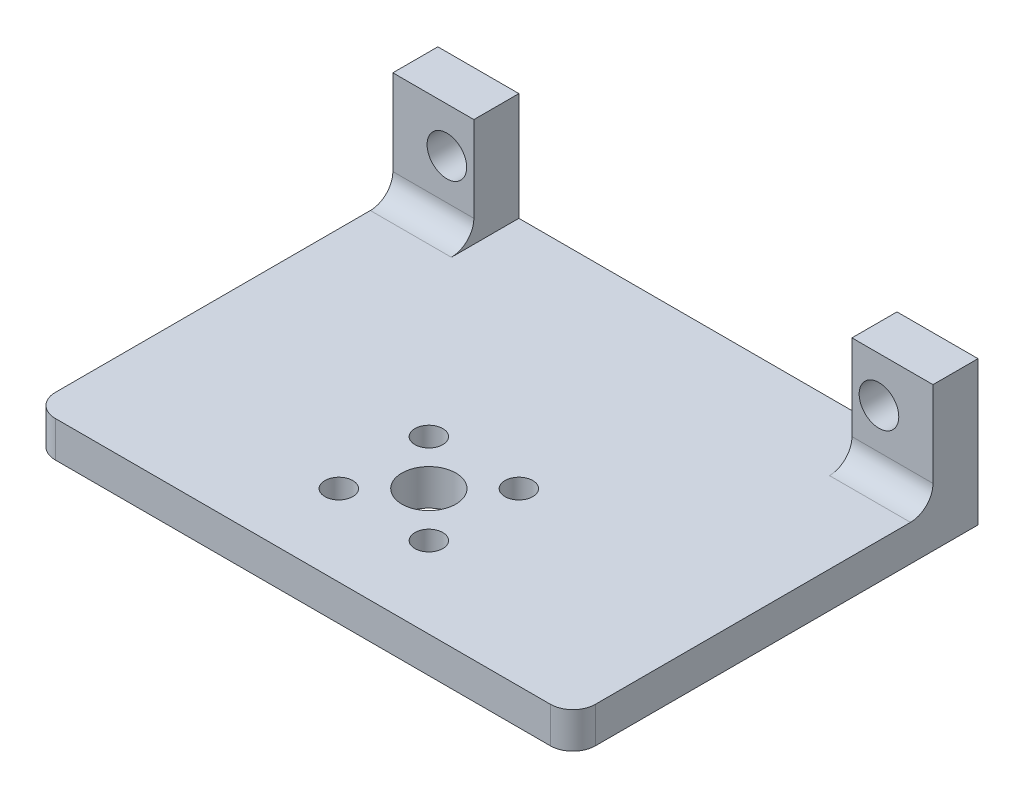
ISO-10303-21;
HEADER;
FILE_DESCRIPTION(('STEP AP214'),'2;1');
FILE_NAME('part.step','',(''),(''),'','','');
FILE_SCHEMA(('AUTOMOTIVE_DESIGN { 1 0 10303 214 1 1 1 1 }'));
ENDSEC;
DATA;
#1=APPLICATION_CONTEXT('core data for automotive mechanical design processes');
#2=APPLICATION_PROTOCOL_DEFINITION('international standard','automotive_design',2000,#1);
#3=PRODUCT_CONTEXT('',#1,'mechanical');
#4=PRODUCT('Part','Part','',(#3));
#5=PRODUCT_RELATED_PRODUCT_CATEGORY('part','',(#4));
#6=PRODUCT_DEFINITION_FORMATION('','',#4);
#7=PRODUCT_DEFINITION_CONTEXT('part definition',#1,'design');
#8=PRODUCT_DEFINITION('design','',#6,#7);
#9=PRODUCT_DEFINITION_SHAPE('','',#8);
#10=(LENGTH_UNIT() NAMED_UNIT(*) SI_UNIT(.MILLI.,.METRE.));
#11=(NAMED_UNIT(*) PLANE_ANGLE_UNIT() SI_UNIT($,.RADIAN.));
#12=(NAMED_UNIT(*) SI_UNIT($,.STERADIAN.) SOLID_ANGLE_UNIT());
#13=UNCERTAINTY_MEASURE_WITH_UNIT(LENGTH_MEASURE(1.E-05),#10,'distance_accuracy_value','');
#14=(GEOMETRIC_REPRESENTATION_CONTEXT(3) GLOBAL_UNCERTAINTY_ASSIGNED_CONTEXT((#13)) GLOBAL_UNIT_ASSIGNED_CONTEXT((#10,
#11,#12)) REPRESENTATION_CONTEXT('',''));
#15=CARTESIAN_POINT('',(0.,0.,0.));
#16=DIRECTION('',(0.,0.,1.));
#17=DIRECTION('',(1.,0.,0.));
#18=AXIS2_PLACEMENT_3D('',#15,#16,#17);
#19=CARTESIAN_POINT('',(0.,7.68517619511929,45.));
#20=DIRECTION('',(0.,1.,0.));
#21=DIRECTION('',(-1.,0.,0.));
#22=AXIS2_PLACEMENT_3D('',#19,#20,#21);
#23=PLANE('',#22);
#24=CARTESIAN_POINT('',(-87.025641025641,7.68517619511928,36.));
#25=DIRECTION('',(0.,1.,0.));
#26=DIRECTION('',(1.,0.,0.));
#27=AXIS2_PLACEMENT_3D('',#24,#25,#26);
#28=CIRCLE('',#27,1.54999999999999);
#29=CARTESIAN_POINT('',(-85.475641025641,7.68517619511928,36.));
#30=VERTEX_POINT('',#29);
#31=EDGE_CURVE('E389',#30,#30,#28,.T.);
#32=ORIENTED_EDGE('',*,*,#31,.F.);
#33=EDGE_LOOP('',(#32));
#34=FACE_BOUND('',#33,.T.);
#35=CARTESIAN_POINT('',(-77.025641025641,7.68517619511928,36.));
#36=DIRECTION('',(0.,1.,0.));
#37=DIRECTION('',(1.,0.,0.));
#38=AXIS2_PLACEMENT_3D('',#35,#36,#37);
#39=CIRCLE('',#38,1.54999999999999);
#40=CARTESIAN_POINT('',(-75.475641025641,7.68517619511928,36.));
#41=VERTEX_POINT('',#40);
#42=EDGE_CURVE('E381',#41,#41,#39,.T.);
#43=ORIENTED_EDGE('',*,*,#42,.F.);
#44=EDGE_LOOP('',(#43));
#45=FACE_BOUND('',#44,.T.);
#46=CARTESIAN_POINT('',(-87.025641025641,7.68517619511928,26.));
#47=DIRECTION('',(0.,1.,0.));
#48=DIRECTION('',(-1.,0.,0.));
#49=AXIS2_PLACEMENT_3D('',#46,#47,#48);
#50=CIRCLE('',#49,1.54999999999999);
#51=CARTESIAN_POINT('',(-88.5756410256409,7.68517619511928,26.));
#52=VERTEX_POINT('',#51);
#53=EDGE_CURVE('E373',#52,#52,#50,.T.);
#54=ORIENTED_EDGE('',*,*,#53,.F.);
#55=EDGE_LOOP('',(#54));
#56=FACE_BOUND('',#55,.T.);
#57=CARTESIAN_POINT('',(-77.025641025641,7.68517619511928,26.));
#58=DIRECTION('',(0.,1.,0.));
#59=DIRECTION('',(-1.,0.,0.));
#60=AXIS2_PLACEMENT_3D('',#57,#58,#59);
#61=CIRCLE('',#60,1.54999999999999);
#62=CARTESIAN_POINT('',(-78.5756410256409,7.68517619511928,26.));
#63=VERTEX_POINT('',#62);
#64=EDGE_CURVE('E364',#63,#63,#61,.T.);
#65=ORIENTED_EDGE('',*,*,#64,.F.);
#66=EDGE_LOOP('',(#65));
#67=FACE_BOUND('',#66,.T.);
#68=CARTESIAN_POINT('',(-82.025641025641,7.68517619511928,31.));
#69=DIRECTION('',(0.,1.,0.));
#70=DIRECTION('',(-1.,0.,0.));
#71=AXIS2_PLACEMENT_3D('',#68,#69,#70);
#72=CIRCLE('',#71,3.00000000000001);
#73=CARTESIAN_POINT('',(-85.025641025641,7.68517619511928,31.));
#74=VERTEX_POINT('',#73);
#75=EDGE_CURVE('E368',#74,#74,#72,.T.);
#76=ORIENTED_EDGE('',*,*,#75,.F.);
#77=EDGE_LOOP('',(#76));
#78=FACE_BOUND('',#77,.T.);
#79=DIRECTION('',(0.,0.,-1.));
#80=VECTOR('',#79,1.);
#81=CARTESIAN_POINT('',(-103.025641025641,7.68517619511928,5.));
#82=LINE('',#81,#80);
#83=CARTESIAN_POINT('',(-103.025641025641,7.68517619511928,7.5));
#84=VERTEX_POINT('',#83);
#85=CARTESIAN_POINT('',(-103.025641025641,7.68517619511928,0.));
#86=VERTEX_POINT('',#85);
#87=EDGE_CURVE('E301',#84,#86,#82,.T.);
#88=ORIENTED_EDGE('',*,*,#87,.F.);
#89=DIRECTION('',(1.,0.,0.));
#90=VECTOR('',#89,1.);
#91=CARTESIAN_POINT('',(-112.025641025641,7.68517619511928,7.5));
#92=LINE('',#91,#90);
#93=CARTESIAN_POINT('',(-112.025641025641,7.68517619511928,7.50000000000001));
#94=VERTEX_POINT('',#93);
#95=EDGE_CURVE('E236',#84,#94,#92,.F.);
#96=ORIENTED_EDGE('',*,*,#95,.T.);
#97=DIRECTION('',(0.,0.,-1.));
#98=VECTOR('',#97,1.);
#99=CARTESIAN_POINT('',(-112.025641025641,7.68517619511928,45.));
#100=LINE('',#99,#98);
#101=CARTESIAN_POINT('',(-112.025641025641,7.68517619511928,42.5));
#102=VERTEX_POINT('',#101);
#103=EDGE_CURVE('E199',#102,#94,#100,.T.);
#104=ORIENTED_EDGE('',*,*,#103,.F.);
#105=CARTESIAN_POINT('',(-109.525641025641,7.68517619511928,42.5));
#106=DIRECTION('',(0.,1.,0.));
#107=DIRECTION('',(-1.,0.,0.));
#108=AXIS2_PLACEMENT_3D('',#105,#106,#107);
#109=CIRCLE('',#108,2.5);
#110=CARTESIAN_POINT('',(-109.525641025641,7.68517619511928,45.));
#111=VERTEX_POINT('',#110);
#112=EDGE_CURVE('E222',#102,#111,#109,.T.);
#113=ORIENTED_EDGE('',*,*,#112,.T.);
#114=DIRECTION('',(1.,0.,0.));
#115=VECTOR('',#114,1.);
#116=CARTESIAN_POINT('',(0.,7.68517619511929,45.));
#117=LINE('',#116,#115);
#118=CARTESIAN_POINT('',(-54.525641025641,7.68517619511929,45.));
#119=VERTEX_POINT('',#118);
#120=EDGE_CURVE('E177',#111,#119,#117,.T.);
#121=ORIENTED_EDGE('',*,*,#120,.T.);
#122=CARTESIAN_POINT('',(-54.525641025641,7.68517619511929,42.5));
#123=DIRECTION('',(0.,1.,0.));
#124=DIRECTION('',(-1.,0.,0.));
#125=AXIS2_PLACEMENT_3D('',#122,#123,#124);
#126=CIRCLE('',#125,2.5);
#127=CARTESIAN_POINT('',(-52.025641025641,7.68517619511929,42.5));
#128=VERTEX_POINT('',#127);
#129=EDGE_CURVE('E225',#119,#128,#126,.T.);
#130=ORIENTED_EDGE('',*,*,#129,.T.);
#131=DIRECTION('',(0.,0.,-1.));
#132=VECTOR('',#131,1.);
#133=CARTESIAN_POINT('',(-52.025641025641,7.68517619511929,45.));
#134=LINE('',#133,#132);
#135=CARTESIAN_POINT('',(-52.025641025641,7.68517619511929,7.50000000000001));
#136=VERTEX_POINT('',#135);
#137=EDGE_CURVE('E189',#128,#136,#134,.T.);
#138=ORIENTED_EDGE('',*,*,#137,.T.);
#139=DIRECTION('',(1.,0.,0.));
#140=VECTOR('',#139,1.);
#141=CARTESIAN_POINT('',(-61.0256410256409,7.68517619511929,7.5));
#142=LINE('',#141,#140);
#143=CARTESIAN_POINT('',(-61.0256410256409,7.68517619511929,7.5));
#144=VERTEX_POINT('',#143);
#145=EDGE_CURVE('E232',#136,#144,#142,.F.);
#146=ORIENTED_EDGE('',*,*,#145,.T.);
#147=DIRECTION('',(0.,0.,-1.));
#148=VECTOR('',#147,1.);
#149=CARTESIAN_POINT('',(-61.0256410256409,7.68517619511929,5.));
#150=LINE('',#149,#148);
#151=CARTESIAN_POINT('',(-61.0256410256409,7.68517619511929,0.));
#152=VERTEX_POINT('',#151);
#153=EDGE_CURVE('E261',#144,#152,#150,.T.);
#154=ORIENTED_EDGE('',*,*,#153,.T.);
#155=DIRECTION('',(1.,0.,0.));
#156=VECTOR('',#155,1.);
#157=CARTESIAN_POINT('',(0.,7.68517619511929,0.));
#158=LINE('',#157,#156);
#159=EDGE_CURVE('E309',#86,#152,#158,.T.);
#160=ORIENTED_EDGE('',*,*,#159,.F.);
#161=EDGE_LOOP('',(#88,#96,#104,#113,#121,#130,#138,#146,#154,#160));
#162=FACE_BOUND('',#161,.T.);
#163=ADVANCED_FACE('F49',(#34,#45,#56,#67,#78,#162),#23,.T.);
#164=CARTESIAN_POINT('',(-112.025641025641,3.8866701879706E-13,45.));
#165=DIRECTION('',(1.,0.,0.));
#166=DIRECTION('',(0.,1.,0.));
#167=AXIS2_PLACEMENT_3D('',#164,#165,#166);
#168=PLANE('',#167);
#169=DIRECTION('',(0.,1.,0.));
#170=VECTOR('',#169,1.);
#171=CARTESIAN_POINT('',(-112.025641025641,0.,5.));
#172=LINE('',#171,#170);
#173=CARTESIAN_POINT('',(-112.025641025641,10.1851761951193,5.));
#174=VERTEX_POINT('',#173);
#175=CARTESIAN_POINT('',(-112.025641025641,19.6851761951193,5.));
#176=VERTEX_POINT('',#175);
#177=EDGE_CURVE('E297',#174,#176,#172,.T.);
#178=ORIENTED_EDGE('',*,*,#177,.T.);
#179=DIRECTION('',(0.,0.,1.));
#180=VECTOR('',#179,1.);
#181=CARTESIAN_POINT('',(-112.025641025641,19.6851761951193,0.));
#182=LINE('',#181,#180);
#183=CARTESIAN_POINT('',(-112.025641025641,19.6851761951193,0.));
#184=VERTEX_POINT('',#183);
#185=EDGE_CURVE('E65',#184,#176,#182,.T.);
#186=ORIENTED_EDGE('',*,*,#185,.F.);
#187=DIRECTION('',(0.,-1.,0.));
#188=VECTOR('',#187,1.);
#189=CARTESIAN_POINT('',(-112.025641025641,3.8866701879706E-13,0.));
#190=LINE('',#189,#188);
#191=CARTESIAN_POINT('',(-112.025641025641,3.68517619511928,0.));
#192=VERTEX_POINT('',#191);
#193=EDGE_CURVE('E185',#184,#192,#190,.T.);
#194=ORIENTED_EDGE('',*,*,#193,.T.);
#195=DIRECTION('',(0.,0.,-1.));
#196=VECTOR('',#195,1.);
#197=CARTESIAN_POINT('',(-112.025641025641,3.68517619511928,45.));
#198=LINE('',#197,#196);
#199=CARTESIAN_POINT('',(-112.025641025641,3.68517619511928,42.5));
#200=VERTEX_POINT('',#199);
#201=EDGE_CURVE('E195',#200,#192,#198,.T.);
#202=ORIENTED_EDGE('',*,*,#201,.F.);
#203=DIRECTION('',(0.,-1.,0.));
#204=VECTOR('',#203,1.);
#205=CARTESIAN_POINT('',(-112.025641025641,7.68517619511928,42.5));
#206=LINE('',#205,#204);
#207=EDGE_CURVE('E206',#200,#102,#206,.F.);
#208=ORIENTED_EDGE('',*,*,#207,.T.);
#209=ORIENTED_EDGE('',*,*,#103,.T.);
#210=CARTESIAN_POINT('',(-112.025641025641,10.1851761951193,7.5));
#211=DIRECTION('',(1.,0.,0.));
#212=DIRECTION('',(0.,1.,0.));
#213=AXIS2_PLACEMENT_3D('',#210,#211,#212);
#214=CIRCLE('',#213,2.5);
#215=EDGE_CURVE('E247',#94,#174,#214,.T.);
#216=ORIENTED_EDGE('',*,*,#215,.T.);
#217=EDGE_LOOP('',(#178,#186,#194,#202,#208,#209,#216));
#218=FACE_BOUND('',#217,.T.);
#219=ADVANCED_FACE('F318',(#218),#168,.F.);
#220=CARTESIAN_POINT('',(0.,3.68517619511929,45.));
#221=DIRECTION('',(0.,1.,0.));
#222=DIRECTION('',(-1.,0.,0.));
#223=AXIS2_PLACEMENT_3D('',#220,#221,#222);
#224=PLANE('',#223);
#225=CARTESIAN_POINT('',(-87.025641025641,3.68517619511928,36.));
#226=DIRECTION('',(0.,1.,0.));
#227=DIRECTION('',(1.,0.,0.));
#228=AXIS2_PLACEMENT_3D('',#225,#226,#227);
#229=CIRCLE('',#228,1.54999999999999);
#230=CARTESIAN_POINT('',(-85.475641025641,3.68517619511928,36.));
#231=VERTEX_POINT('',#230);
#232=EDGE_CURVE('E360',#231,#231,#229,.T.);
#233=ORIENTED_EDGE('',*,*,#232,.T.);
#234=EDGE_LOOP('',(#233));
#235=FACE_BOUND('',#234,.T.);
#236=CARTESIAN_POINT('',(-77.025641025641,3.68517619511928,36.));
#237=DIRECTION('',(0.,1.,0.));
#238=DIRECTION('',(1.,0.,0.));
#239=AXIS2_PLACEMENT_3D('',#236,#237,#238);
#240=CIRCLE('',#239,1.54999999999999);
#241=CARTESIAN_POINT('',(-75.475641025641,3.68517619511928,36.));
#242=VERTEX_POINT('',#241);
#243=EDGE_CURVE('E385',#242,#242,#240,.T.);
#244=ORIENTED_EDGE('',*,*,#243,.T.);
#245=EDGE_LOOP('',(#244));
#246=FACE_BOUND('',#245,.T.);
#247=CARTESIAN_POINT('',(-87.025641025641,3.68517619511928,26.));
#248=DIRECTION('',(0.,1.,0.));
#249=DIRECTION('',(-1.,0.,0.));
#250=AXIS2_PLACEMENT_3D('',#247,#248,#249);
#251=CIRCLE('',#250,1.54999999999999);
#252=CARTESIAN_POINT('',(-88.5756410256409,3.68517619511928,26.));
#253=VERTEX_POINT('',#252);
#254=EDGE_CURVE('E377',#253,#253,#251,.T.);
#255=ORIENTED_EDGE('',*,*,#254,.T.);
#256=EDGE_LOOP('',(#255));
#257=FACE_BOUND('',#256,.T.);
#258=CARTESIAN_POINT('',(-77.025641025641,3.68517619511928,26.));
#259=DIRECTION('',(0.,1.,0.));
#260=DIRECTION('',(-1.,0.,0.));
#261=AXIS2_PLACEMENT_3D('',#258,#259,#260);
#262=CIRCLE('',#261,1.54999999999999);
#263=CARTESIAN_POINT('',(-78.5756410256409,3.68517619511928,26.));
#264=VERTEX_POINT('',#263);
#265=EDGE_CURVE('E369',#264,#264,#262,.T.);
#266=ORIENTED_EDGE('',*,*,#265,.T.);
#267=EDGE_LOOP('',(#266));
#268=FACE_BOUND('',#267,.T.);
#269=CARTESIAN_POINT('',(-82.025641025641,3.68517619511928,31.));
#270=DIRECTION('',(0.,1.,0.));
#271=DIRECTION('',(-1.,0.,0.));
#272=AXIS2_PLACEMENT_3D('',#269,#270,#271);
#273=CIRCLE('',#272,3.00000000000001);
#274=CARTESIAN_POINT('',(-85.025641025641,3.68517619511928,31.));
#275=VERTEX_POINT('',#274);
#276=EDGE_CURVE('E283',#275,#275,#273,.T.);
#277=ORIENTED_EDGE('',*,*,#276,.T.);
#278=EDGE_LOOP('',(#277));
#279=FACE_BOUND('',#278,.T.);
#280=DIRECTION('',(0.,0.,-1.));
#281=VECTOR('',#280,1.);
#282=CARTESIAN_POINT('',(-52.0256410256409,3.68517619511929,45.));
#283=LINE('',#282,#281);
#284=CARTESIAN_POINT('',(-52.0256410256409,3.68517619511929,42.5));
#285=VERTEX_POINT('',#284);
#286=CARTESIAN_POINT('',(-52.0256410256409,3.68517619511929,0.));
#287=VERTEX_POINT('',#286);
#288=EDGE_CURVE('E174',#285,#287,#283,.T.);
#289=ORIENTED_EDGE('',*,*,#288,.F.);
#290=CARTESIAN_POINT('',(-54.5256410256409,3.68517619511929,42.5));
#291=DIRECTION('',(0.,1.,0.));
#292=DIRECTION('',(-1.,0.,0.));
#293=AXIS2_PLACEMENT_3D('',#290,#291,#292);
#294=CIRCLE('',#293,2.5);
#295=CARTESIAN_POINT('',(-54.5256410256409,3.68517619511929,45.));
#296=VERTEX_POINT('',#295);
#297=EDGE_CURVE('E212',#285,#296,#294,.F.);
#298=ORIENTED_EDGE('',*,*,#297,.T.);
#299=DIRECTION('',(1.,0.,0.));
#300=VECTOR('',#299,1.);
#301=CARTESIAN_POINT('',(0.,3.68517619511929,45.));
#302=LINE('',#301,#300);
#303=CARTESIAN_POINT('',(-109.525641025641,3.68517619511928,45.));
#304=VERTEX_POINT('',#303);
#305=EDGE_CURVE('E183',#304,#296,#302,.T.);
#306=ORIENTED_EDGE('',*,*,#305,.F.);
#307=CARTESIAN_POINT('',(-109.525641025641,3.68517619511928,42.5));
#308=DIRECTION('',(0.,1.,0.));
#309=DIRECTION('',(-1.,0.,0.));
#310=AXIS2_PLACEMENT_3D('',#307,#308,#309);
#311=CIRCLE('',#310,2.5);
#312=EDGE_CURVE('E209',#304,#200,#311,.F.);
#313=ORIENTED_EDGE('',*,*,#312,.T.);
#314=ORIENTED_EDGE('',*,*,#201,.T.);
#315=DIRECTION('',(1.,0.,0.));
#316=VECTOR('',#315,1.);
#317=CARTESIAN_POINT('',(0.,3.68517619511929,0.));
#318=LINE('',#317,#316);
#319=EDGE_CURVE('E178',#192,#287,#318,.T.);
#320=ORIENTED_EDGE('',*,*,#319,.T.);
#321=EDGE_LOOP('',(#289,#298,#306,#313,#314,#320));
#322=FACE_BOUND('',#321,.T.);
#323=ADVANCED_FACE('F322',(#235,#246,#257,#268,#279,#322),#224,.F.);
#324=CARTESIAN_POINT('',(-52.0256410256409,-1.80500201679843E-13,45.));
#325=DIRECTION('',(1.,0.,0.));
#326=DIRECTION('',(0.,1.,0.));
#327=AXIS2_PLACEMENT_3D('',#324,#325,#326);
#328=PLANE('',#327);
#329=DIRECTION('',(0.,0.,1.));
#330=VECTOR('',#329,1.);
#331=CARTESIAN_POINT('',(-52.0256410256409,19.6851761951191,0.));
#332=LINE('',#331,#330);
#333=CARTESIAN_POINT('',(-52.0256410256409,19.6851761951191,0.));
#334=VERTEX_POINT('',#333);
#335=CARTESIAN_POINT('',(-52.0256410256409,19.6851761951191,5.));
#336=VERTEX_POINT('',#335);
#337=EDGE_CURVE('E148',#334,#336,#332,.T.);
#338=ORIENTED_EDGE('',*,*,#337,.T.);
#339=DIRECTION('',(0.,1.,0.));
#340=VECTOR('',#339,1.);
#341=CARTESIAN_POINT('',(-52.025641025641,0.,5.));
#342=LINE('',#341,#340);
#343=CARTESIAN_POINT('',(-52.0256410256409,10.1851761951193,5.));
#344=VERTEX_POINT('',#343);
#345=EDGE_CURVE('E267',#344,#336,#342,.T.);
#346=ORIENTED_EDGE('',*,*,#345,.F.);
#347=CARTESIAN_POINT('',(-52.025641025641,10.1851761951193,7.5));
#348=DIRECTION('',(1.,0.,0.));
#349=DIRECTION('',(0.,1.,0.));
#350=AXIS2_PLACEMENT_3D('',#347,#348,#349);
#351=CIRCLE('',#350,2.5);
#352=EDGE_CURVE('E250',#344,#136,#351,.F.);
#353=ORIENTED_EDGE('',*,*,#352,.T.);
#354=ORIENTED_EDGE('',*,*,#137,.F.);
#355=DIRECTION('',(0.,-1.,0.));
#356=VECTOR('',#355,1.);
#357=CARTESIAN_POINT('',(-52.0256410256409,-1.80500201679843E-13,42.5));
#358=LINE('',#357,#356);
#359=EDGE_CURVE('E203',#128,#285,#358,.T.);
#360=ORIENTED_EDGE('',*,*,#359,.T.);
#361=ORIENTED_EDGE('',*,*,#288,.T.);
#362=DIRECTION('',(0.,-1.,0.));
#363=VECTOR('',#362,1.);
#364=CARTESIAN_POINT('',(-52.0256410256409,-1.80500201679843E-13,0.));
#365=LINE('',#364,#363);
#366=EDGE_CURVE('E165',#334,#287,#365,.T.);
#367=ORIENTED_EDGE('',*,*,#366,.F.);
#368=EDGE_LOOP('',(#338,#346,#353,#354,#360,#361,#367));
#369=FACE_BOUND('',#368,.T.);
#370=ADVANCED_FACE('F171',(#369),#328,.T.);
#371=CARTESIAN_POINT('',(0.,0.,45.));
#372=DIRECTION('',(0.,0.,1.));
#373=DIRECTION('',(1.,0.,0.));
#374=AXIS2_PLACEMENT_3D('',#371,#372,#373);
#375=PLANE('',#374);
#376=ORIENTED_EDGE('',*,*,#305,.T.);
#377=DIRECTION('',(0.,-1.,0.));
#378=VECTOR('',#377,1.);
#379=CARTESIAN_POINT('',(-54.5256410256409,-1.89173819059727E-13,45.));
#380=LINE('',#379,#378);
#381=EDGE_CURVE('E219',#296,#119,#380,.F.);
#382=ORIENTED_EDGE('',*,*,#381,.T.);
#383=ORIENTED_EDGE('',*,*,#120,.F.);
#384=DIRECTION('',(0.,-1.,0.));
#385=VECTOR('',#384,1.);
#386=CARTESIAN_POINT('',(-109.525641025641,3.68517619511927,45.));
#387=LINE('',#386,#385);
#388=EDGE_CURVE('E215',#111,#304,#387,.T.);
#389=ORIENTED_EDGE('',*,*,#388,.T.);
#390=EDGE_LOOP('',(#376,#382,#383,#389));
#391=FACE_BOUND('',#390,.T.);
#392=ADVANCED_FACE('F330',(#391),#375,.T.);
#393=CARTESIAN_POINT('',(0.,0.,0.));
#394=DIRECTION('',(0.,0.,1.));
#395=DIRECTION('',(1.,0.,0.));
#396=AXIS2_PLACEMENT_3D('',#393,#394,#395);
#397=PLANE('',#396);
#398=ORIENTED_EDGE('',*,*,#193,.F.);
#399=DIRECTION('',(-1.,0.,0.));
#400=VECTOR('',#399,1.);
#401=CARTESIAN_POINT('',(-52.0256410256409,19.6851761951191,0.));
#402=LINE('',#401,#400);
#403=CARTESIAN_POINT('',(-103.025641025641,19.6851761951192,0.));
#404=VERTEX_POINT('',#403);
#405=EDGE_CURVE('E157',#404,#184,#402,.T.);
#406=ORIENTED_EDGE('',*,*,#405,.F.);
#407=DIRECTION('',(0.,-1.,0.));
#408=VECTOR('',#407,1.);
#409=CARTESIAN_POINT('',(-103.025641025641,-9.53178656611939E-13,0.));
#410=LINE('',#409,#408);
#411=EDGE_CURVE('E294',#404,#86,#410,.T.);
#412=ORIENTED_EDGE('',*,*,#411,.T.);
#413=ORIENTED_EDGE('',*,*,#159,.T.);
#414=DIRECTION('',(0.,-1.,0.));
#415=VECTOR('',#414,1.);
#416=CARTESIAN_POINT('',(-61.0256410256409,0.,0.));
#417=LINE('',#416,#415);
#418=CARTESIAN_POINT('',(-61.0256410256409,19.6851761951191,0.));
#419=VERTEX_POINT('',#418);
#420=EDGE_CURVE('E168',#419,#152,#417,.T.);
#421=ORIENTED_EDGE('',*,*,#420,.F.);
#422=EDGE_CURVE('E151',#334,#419,#402,.T.);
#423=ORIENTED_EDGE('',*,*,#422,.F.);
#424=ORIENTED_EDGE('',*,*,#366,.T.);
#425=ORIENTED_EDGE('',*,*,#319,.F.);
#426=EDGE_LOOP('',(#398,#406,#412,#413,#421,#423,#424,#425));
#427=FACE_BOUND('',#426,.T.);
#428=CARTESIAN_POINT('',(-106.025641025641,14.6851761951193,0.));
#429=DIRECTION('',(0.,0.,1.));
#430=DIRECTION('',(1.,0.,0.));
#431=AXIS2_PLACEMENT_3D('',#428,#429,#430);
#432=CIRCLE('',#431,2.20000000000001);
#433=CARTESIAN_POINT('',(-103.825641025641,14.6851761951193,0.));
#434=VERTEX_POINT('',#433);
#435=EDGE_CURVE('E288',#434,#434,#432,.T.);
#436=ORIENTED_EDGE('',*,*,#435,.T.);
#437=EDGE_LOOP('',(#436));
#438=FACE_BOUND('',#437,.T.);
#439=CARTESIAN_POINT('',(-58.0256410256409,14.6851761951193,0.));
#440=DIRECTION('',(0.,0.,1.));
#441=DIRECTION('',(1.,0.,0.));
#442=AXIS2_PLACEMENT_3D('',#439,#440,#441);
#443=CIRCLE('',#442,2.20000000000001);
#444=CARTESIAN_POINT('',(-55.8256410256409,14.6851761951193,0.));
#445=VERTEX_POINT('',#444);
#446=EDGE_CURVE('E279',#445,#445,#443,.F.);
#447=ORIENTED_EDGE('',*,*,#446,.F.);
#448=EDGE_LOOP('',(#447));
#449=FACE_BOUND('',#448,.T.);
#450=ADVANCED_FACE('F162',(#427,#438,#449),#397,.F.);
#451=CARTESIAN_POINT('',(-103.025641025641,-9.53178656611939E-13,5.));
#452=DIRECTION('',(1.,0.,0.));
#453=DIRECTION('',(0.,1.,0.));
#454=AXIS2_PLACEMENT_3D('',#451,#452,#453);
#455=PLANE('',#454);
#456=DIRECTION('',(0.,0.,-1.));
#457=VECTOR('',#456,1.);
#458=CARTESIAN_POINT('',(-103.025641025641,19.6851761951192,5.));
#459=LINE('',#458,#457);
#460=CARTESIAN_POINT('',(-103.025641025641,19.6851761951192,5.));
#461=VERTEX_POINT('',#460);
#462=EDGE_CURVE('E343',#461,#404,#459,.T.);
#463=ORIENTED_EDGE('',*,*,#462,.F.);
#464=DIRECTION('',(0.,-1.,0.));
#465=VECTOR('',#464,1.);
#466=CARTESIAN_POINT('',(-103.025641025641,-9.53178656611939E-13,5.));
#467=LINE('',#466,#465);
#468=CARTESIAN_POINT('',(-103.025641025641,10.1851761951193,5.));
#469=VERTEX_POINT('',#468);
#470=EDGE_CURVE('E293',#461,#469,#467,.T.);
#471=ORIENTED_EDGE('',*,*,#470,.T.);
#472=CARTESIAN_POINT('',(-103.025641025641,10.1851761951193,7.5));
#473=DIRECTION('',(1.,0.,0.));
#474=DIRECTION('',(0.,1.,0.));
#475=AXIS2_PLACEMENT_3D('',#472,#473,#474);
#476=CIRCLE('',#475,2.5);
#477=EDGE_CURVE('E243',#469,#84,#476,.F.);
#478=ORIENTED_EDGE('',*,*,#477,.T.);
#479=ORIENTED_EDGE('',*,*,#87,.T.);
#480=ORIENTED_EDGE('',*,*,#411,.F.);
#481=EDGE_LOOP('',(#463,#471,#478,#479,#480));
#482=FACE_BOUND('',#481,.T.);
#483=ADVANCED_FACE('F342',(#482),#455,.T.);
#484=CARTESIAN_POINT('',(-106.025641025641,14.6851761951193,5.));
#485=DIRECTION('',(0.,0.,-1.));
#486=DIRECTION('',(-1.,0.,0.));
#487=AXIS2_PLACEMENT_3D('',#484,#485,#486);
#488=CYLINDRICAL_SURFACE('',#487,2.20000000000001);
#489=CARTESIAN_POINT('',(-106.025641025641,14.6851761951193,5.));
#490=DIRECTION('',(0.,0.,1.));
#491=DIRECTION('',(1.,0.,0.));
#492=AXIS2_PLACEMENT_3D('',#489,#490,#491);
#493=CIRCLE('',#492,2.20000000000001);
#494=CARTESIAN_POINT('',(-103.825641025641,14.6851761951193,5.));
#495=VERTEX_POINT('',#494);
#496=EDGE_CURVE('E289',#495,#495,#493,.T.);
#497=ORIENTED_EDGE('',*,*,#496,.T.);
#498=EDGE_LOOP('',(#497));
#499=FACE_BOUND('',#498,.T.);
#500=ORIENTED_EDGE('',*,*,#435,.F.);
#501=EDGE_LOOP('',(#500));
#502=FACE_BOUND('',#501,.T.);
#503=ADVANCED_FACE('F460',(#499,#502),#488,.F.);
#504=CARTESIAN_POINT('',(0.,0.,5.));
#505=DIRECTION('',(0.,0.,1.));
#506=DIRECTION('',(1.,0.,0.));
#507=AXIS2_PLACEMENT_3D('',#504,#505,#506);
#508=PLANE('',#507);
#509=DIRECTION('',(1.,0.,0.));
#510=VECTOR('',#509,1.);
#511=CARTESIAN_POINT('',(0.,19.6851761951189,5.));
#512=LINE('',#511,#510);
#513=EDGE_CURVE('E355',#176,#461,#512,.T.);
#514=ORIENTED_EDGE('',*,*,#513,.F.);
#515=ORIENTED_EDGE('',*,*,#177,.F.);
#516=DIRECTION('',(1.,0.,0.));
#517=VECTOR('',#516,1.);
#518=CARTESIAN_POINT('',(-103.025641025641,10.1851761951193,5.));
#519=LINE('',#518,#517);
#520=EDGE_CURVE('E228',#174,#469,#519,.T.);
#521=ORIENTED_EDGE('',*,*,#520,.T.);
#522=ORIENTED_EDGE('',*,*,#470,.F.);
#523=EDGE_LOOP('',(#514,#515,#521,#522));
#524=FACE_BOUND('',#523,.T.);
#525=ORIENTED_EDGE('',*,*,#496,.F.);
#526=EDGE_LOOP('',(#525));
#527=FACE_BOUND('',#526,.T.);
#528=ADVANCED_FACE('F353',(#524,#527),#508,.T.);
#529=CARTESIAN_POINT('',(-61.0256410256409,0.,5.));
#530=DIRECTION('',(1.,0.,0.));
#531=DIRECTION('',(0.,0.,-1.));
#532=AXIS2_PLACEMENT_3D('',#529,#530,#531);
#533=PLANE('',#532);
#534=DIRECTION('',(0.,-1.,0.));
#535=VECTOR('',#534,1.);
#536=CARTESIAN_POINT('',(-61.0256410256409,0.,5.));
#537=LINE('',#536,#535);
#538=CARTESIAN_POINT('',(-61.0256410256409,19.6851761951191,5.));
#539=VERTEX_POINT('',#538);
#540=CARTESIAN_POINT('',(-61.0256410256409,10.1851761951193,5.));
#541=VERTEX_POINT('',#540);
#542=EDGE_CURVE('E259',#539,#541,#537,.T.);
#543=ORIENTED_EDGE('',*,*,#542,.F.);
#544=DIRECTION('',(0.,0.,-1.));
#545=VECTOR('',#544,1.);
#546=CARTESIAN_POINT('',(-61.0256410256409,19.6851761951191,5.));
#547=LINE('',#546,#545);
#548=EDGE_CURVE('E72',#539,#419,#547,.T.);
#549=ORIENTED_EDGE('',*,*,#548,.T.);
#550=ORIENTED_EDGE('',*,*,#420,.T.);
#551=ORIENTED_EDGE('',*,*,#153,.F.);
#552=CARTESIAN_POINT('',(-61.0256410256409,10.1851761951193,7.5));
#553=DIRECTION('',(1.,0.,0.));
#554=DIRECTION('',(0.,0.,-1.));
#555=AXIS2_PLACEMENT_3D('',#552,#553,#554);
#556=CIRCLE('',#555,2.5);
#557=EDGE_CURVE('E58',#144,#541,#556,.T.);
#558=ORIENTED_EDGE('',*,*,#557,.T.);
#559=EDGE_LOOP('',(#543,#549,#550,#551,#558));
#560=FACE_BOUND('',#559,.T.);
#561=ADVANCED_FACE('F258',(#560),#533,.F.);
#562=CARTESIAN_POINT('',(-58.0256410256409,14.6851761951193,5.));
#563=DIRECTION('',(0.,0.,-1.));
#564=DIRECTION('',(-1.,0.,0.));
#565=AXIS2_PLACEMENT_3D('',#562,#563,#564);
#566=CYLINDRICAL_SURFACE('',#565,2.20000000000001);
#567=CARTESIAN_POINT('',(-58.0256410256409,14.6851761951193,5.));
#568=DIRECTION('',(0.,0.,1.));
#569=DIRECTION('',(1.,0.,0.));
#570=AXIS2_PLACEMENT_3D('',#567,#568,#569);
#571=CIRCLE('',#570,2.20000000000001);
#572=CARTESIAN_POINT('',(-55.8256410256409,14.6851761951193,5.));
#573=VERTEX_POINT('',#572);
#574=EDGE_CURVE('E270',#573,#573,#571,.F.);
#575=ORIENTED_EDGE('',*,*,#574,.F.);
#576=EDGE_LOOP('',(#575));
#577=FACE_BOUND('',#576,.T.);
#578=ORIENTED_EDGE('',*,*,#446,.T.);
#579=EDGE_LOOP('',(#578));
#580=FACE_BOUND('',#579,.T.);
#581=ADVANCED_FACE('F452',(#577,#580),#566,.F.);
#582=CARTESIAN_POINT('',(0.,0.,5.));
#583=DIRECTION('',(0.,0.,1.));
#584=DIRECTION('',(1.,0.,0.));
#585=AXIS2_PLACEMENT_3D('',#582,#583,#584);
#586=PLANE('',#585);
#587=DIRECTION('',(1.,0.,0.));
#588=VECTOR('',#587,1.);
#589=CARTESIAN_POINT('',(0.,19.6851761951189,5.));
#590=LINE('',#589,#588);
#591=EDGE_CURVE('E11',#539,#336,#590,.T.);
#592=ORIENTED_EDGE('',*,*,#591,.F.);
#593=ORIENTED_EDGE('',*,*,#542,.T.);
#594=DIRECTION('',(1.,0.,0.));
#595=VECTOR('',#594,1.);
#596=CARTESIAN_POINT('',(-52.025641025641,10.1851761951193,5.));
#597=LINE('',#596,#595);
#598=EDGE_CURVE('E239',#541,#344,#597,.T.);
#599=ORIENTED_EDGE('',*,*,#598,.T.);
#600=ORIENTED_EDGE('',*,*,#345,.T.);
#601=EDGE_LOOP('',(#592,#593,#599,#600));
#602=FACE_BOUND('',#601,.T.);
#603=ORIENTED_EDGE('',*,*,#574,.T.);
#604=EDGE_LOOP('',(#603));
#605=FACE_BOUND('',#604,.T.);
#606=ADVANCED_FACE('F265',(#602,#605),#586,.T.);
#607=CARTESIAN_POINT('',(-82.025641025641,3.68517619511928,31.));
#608=DIRECTION('',(0.,1.,0.));
#609=DIRECTION('',(-1.,0.,0.));
#610=AXIS2_PLACEMENT_3D('',#607,#608,#609);
#611=CYLINDRICAL_SURFACE('',#610,3.00000000000001);
#612=ORIENTED_EDGE('',*,*,#276,.F.);
#613=EDGE_LOOP('',(#612));
#614=FACE_BOUND('',#613,.T.);
#615=ORIENTED_EDGE('',*,*,#75,.T.);
#616=EDGE_LOOP('',(#615));
#617=FACE_BOUND('',#616,.T.);
#618=ADVANCED_FACE('F402',(#614,#617),#611,.F.);
#619=CARTESIAN_POINT('',(-77.025641025641,3.68517619511928,26.));
#620=DIRECTION('',(0.,1.,0.));
#621=DIRECTION('',(-1.,0.,0.));
#622=AXIS2_PLACEMENT_3D('',#619,#620,#621);
#623=CYLINDRICAL_SURFACE('',#622,1.54999999999999);
#624=ORIENTED_EDGE('',*,*,#265,.F.);
#625=EDGE_LOOP('',(#624));
#626=FACE_BOUND('',#625,.T.);
#627=ORIENTED_EDGE('',*,*,#64,.T.);
#628=EDGE_LOOP('',(#627));
#629=FACE_BOUND('',#628,.T.);
#630=ADVANCED_FACE('F433',(#626,#629),#623,.F.);
#631=CARTESIAN_POINT('',(-87.025641025641,3.68517619511928,26.));
#632=DIRECTION('',(0.,1.,0.));
#633=DIRECTION('',(-1.,0.,0.));
#634=AXIS2_PLACEMENT_3D('',#631,#632,#633);
#635=CYLINDRICAL_SURFACE('',#634,1.54999999999999);
#636=ORIENTED_EDGE('',*,*,#254,.F.);
#637=EDGE_LOOP('',(#636));
#638=FACE_BOUND('',#637,.T.);
#639=ORIENTED_EDGE('',*,*,#53,.T.);
#640=EDGE_LOOP('',(#639));
#641=FACE_BOUND('',#640,.T.);
#642=ADVANCED_FACE('F436',(#638,#641),#635,.F.);
#643=CARTESIAN_POINT('',(-77.025641025641,3.68517619511928,36.));
#644=DIRECTION('',(0.,1.,0.));
#645=DIRECTION('',(-1.,0.,0.));
#646=AXIS2_PLACEMENT_3D('',#643,#644,#645);
#647=CYLINDRICAL_SURFACE('',#646,1.54999999999999);
#648=ORIENTED_EDGE('',*,*,#243,.F.);
#649=EDGE_LOOP('',(#648));
#650=FACE_BOUND('',#649,.T.);
#651=ORIENTED_EDGE('',*,*,#42,.T.);
#652=EDGE_LOOP('',(#651));
#653=FACE_BOUND('',#652,.T.);
#654=ADVANCED_FACE('F440',(#650,#653),#647,.F.);
#655=CARTESIAN_POINT('',(-87.025641025641,3.68517619511928,36.));
#656=DIRECTION('',(0.,1.,0.));
#657=DIRECTION('',(-1.,0.,0.));
#658=AXIS2_PLACEMENT_3D('',#655,#656,#657);
#659=CYLINDRICAL_SURFACE('',#658,1.54999999999999);
#660=ORIENTED_EDGE('',*,*,#232,.F.);
#661=EDGE_LOOP('',(#660));
#662=FACE_BOUND('',#661,.T.);
#663=ORIENTED_EDGE('',*,*,#31,.T.);
#664=EDGE_LOOP('',(#663));
#665=FACE_BOUND('',#664,.T.);
#666=ADVANCED_FACE('F419',(#662,#665),#659,.F.);
#667=CARTESIAN_POINT('',(-54.5256410256409,-1.89173819059727E-13,42.5));
#668=DIRECTION('',(0.,-1.,0.));
#669=DIRECTION('',(1.,0.,0.));
#670=AXIS2_PLACEMENT_3D('',#667,#668,#669);
#671=CYLINDRICAL_SURFACE('',#670,2.5);
#672=ORIENTED_EDGE('',*,*,#129,.F.);
#673=ORIENTED_EDGE('',*,*,#381,.F.);
#674=ORIENTED_EDGE('',*,*,#297,.F.);
#675=ORIENTED_EDGE('',*,*,#359,.F.);
#676=EDGE_LOOP('',(#672,#673,#674,#675));
#677=FACE_BOUND('',#676,.T.);
#678=ADVANCED_FACE('F337',(#677),#671,.T.);
#679=CARTESIAN_POINT('',(-109.525641025641,3.79993401417176E-13,42.5));
#680=DIRECTION('',(0.,1.,0.));
#681=DIRECTION('',(-1.,0.,0.));
#682=AXIS2_PLACEMENT_3D('',#679,#680,#681);
#683=CYLINDRICAL_SURFACE('',#682,2.5);
#684=ORIENTED_EDGE('',*,*,#112,.F.);
#685=ORIENTED_EDGE('',*,*,#207,.F.);
#686=ORIENTED_EDGE('',*,*,#312,.F.);
#687=ORIENTED_EDGE('',*,*,#388,.F.);
#688=EDGE_LOOP('',(#684,#685,#686,#687));
#689=FACE_BOUND('',#688,.T.);
#690=ADVANCED_FACE('F327',(#689),#683,.T.);
#691=CARTESIAN_POINT('',(0.,10.1851761951193,7.5));
#692=DIRECTION('',(-1.,0.,0.));
#693=DIRECTION('',(0.,-1.,0.));
#694=AXIS2_PLACEMENT_3D('',#691,#692,#693);
#695=CYLINDRICAL_SURFACE('',#694,2.5);
#696=ORIENTED_EDGE('',*,*,#215,.F.);
#697=ORIENTED_EDGE('',*,*,#95,.F.);
#698=ORIENTED_EDGE('',*,*,#477,.F.);
#699=ORIENTED_EDGE('',*,*,#520,.F.);
#700=EDGE_LOOP('',(#696,#697,#698,#699));
#701=FACE_BOUND('',#700,.T.);
#702=ADVANCED_FACE('F351',(#701),#695,.F.);
#703=CARTESIAN_POINT('',(0.,10.1851761951193,7.5));
#704=DIRECTION('',(-1.,0.,0.));
#705=DIRECTION('',(0.,-1.,0.));
#706=AXIS2_PLACEMENT_3D('',#703,#704,#705);
#707=CYLINDRICAL_SURFACE('',#706,2.5);
#708=ORIENTED_EDGE('',*,*,#557,.F.);
#709=ORIENTED_EDGE('',*,*,#145,.F.);
#710=ORIENTED_EDGE('',*,*,#352,.F.);
#711=ORIENTED_EDGE('',*,*,#598,.F.);
#712=EDGE_LOOP('',(#708,#709,#710,#711));
#713=FACE_BOUND('',#712,.T.);
#714=ADVANCED_FACE('F51',(#713),#707,.F.);
#715=CARTESIAN_POINT('',(-52.0256410256409,19.6851761951191,0.));
#716=DIRECTION('',(0.,-1.,0.));
#717=DIRECTION('',(1.,0.,0.));
#718=AXIS2_PLACEMENT_3D('',#715,#716,#717);
#719=PLANE('',#718);
#720=ORIENTED_EDGE('',*,*,#591,.T.);
#721=ORIENTED_EDGE('',*,*,#337,.F.);
#722=ORIENTED_EDGE('',*,*,#422,.T.);
#723=ORIENTED_EDGE('',*,*,#548,.F.);
#724=EDGE_LOOP('',(#720,#721,#722,#723));
#725=FACE_BOUND('',#724,.T.);
#726=ADVANCED_FACE('F150',(#725),#719,.F.);
#727=ORIENTED_EDGE('',*,*,#462,.T.);
#728=ORIENTED_EDGE('',*,*,#405,.T.);
#729=ORIENTED_EDGE('',*,*,#185,.T.);
#730=ORIENTED_EDGE('',*,*,#513,.T.);
#731=EDGE_LOOP('',(#727,#728,#729,#730));
#732=FACE_BOUND('',#731,.T.);
#733=ADVANCED_FACE('F426',(#732),#719,.F.);
#734=CLOSED_SHELL('',(#163,#219,#323,#370,#392,#450,#483,#503,#528,#561,#581,#606,#618,#630,
#642,#654,#666,#678,#690,#702,#714,#726,#733));
#735=MANIFOLD_SOLID_BREP('B2',#734);
#736=ADVANCED_BREP_SHAPE_REPRESENTATION('',(#18,#735),#14);
#737=SHAPE_DEFINITION_REPRESENTATION(#9,#736);
ENDSEC;
END-ISO-10303-21;
